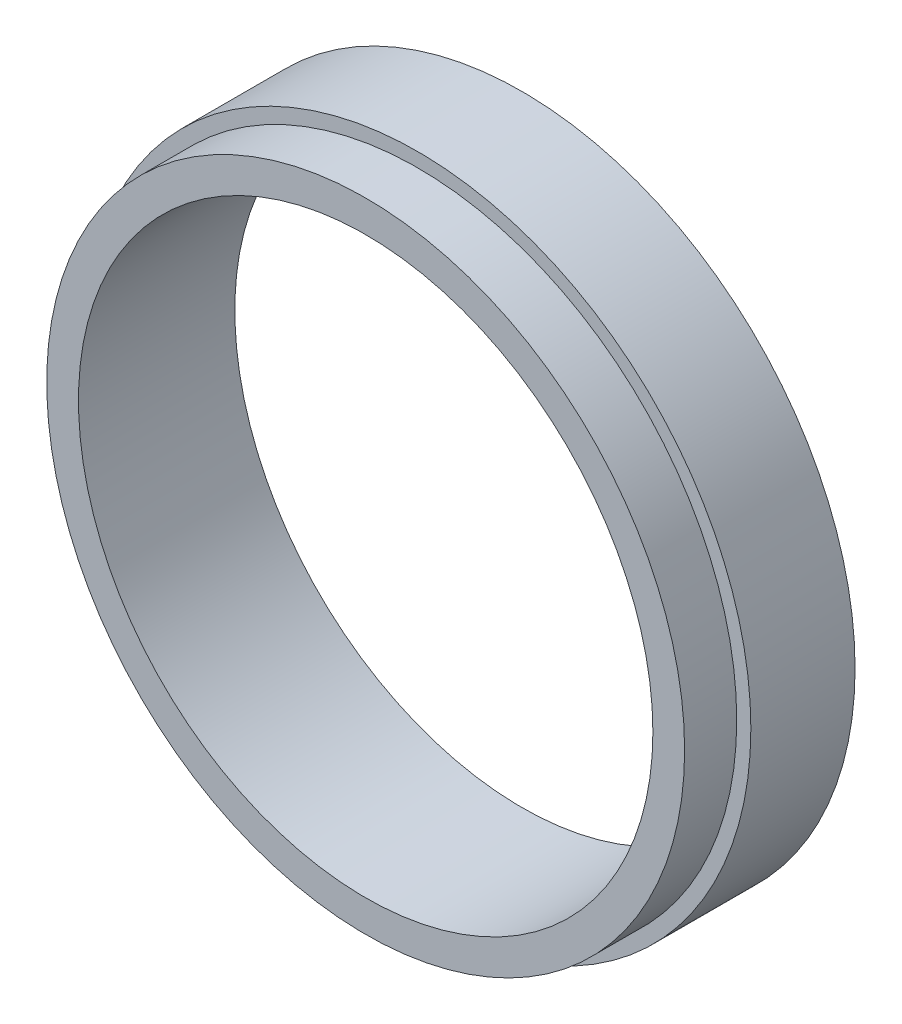
ISO-10303-21;
HEADER;
FILE_DESCRIPTION(('STEP AP214'),'2;1');
FILE_NAME('part.step','',(''),(''),'','','');
FILE_SCHEMA(('AUTOMOTIVE_DESIGN { 1 0 10303 214 1 1 1 1 }'));
ENDSEC;
DATA;
#1=APPLICATION_CONTEXT('core data for automotive mechanical design processes');
#2=APPLICATION_PROTOCOL_DEFINITION('international standard','automotive_design',2000,#1);
#3=PRODUCT_CONTEXT('',#1,'mechanical');
#4=PRODUCT('Part','Part','',(#3));
#5=PRODUCT_RELATED_PRODUCT_CATEGORY('part','',(#4));
#6=PRODUCT_DEFINITION_FORMATION('','',#4);
#7=PRODUCT_DEFINITION_CONTEXT('part definition',#1,'design');
#8=PRODUCT_DEFINITION('design','',#6,#7);
#9=PRODUCT_DEFINITION_SHAPE('','',#8);
#10=(LENGTH_UNIT() NAMED_UNIT(*) SI_UNIT(.MILLI.,.METRE.));
#11=(NAMED_UNIT(*) PLANE_ANGLE_UNIT() SI_UNIT($,.RADIAN.));
#12=(NAMED_UNIT(*) SI_UNIT($,.STERADIAN.) SOLID_ANGLE_UNIT());
#13=UNCERTAINTY_MEASURE_WITH_UNIT(LENGTH_MEASURE(1.E-05),#10,'distance_accuracy_value','');
#14=(GEOMETRIC_REPRESENTATION_CONTEXT(3) GLOBAL_UNCERTAINTY_ASSIGNED_CONTEXT((#13)) GLOBAL_UNIT_ASSIGNED_CONTEXT((#10,
#11,#12)) REPRESENTATION_CONTEXT('',''));
#15=CARTESIAN_POINT('',(0.,0.,0.));
#16=DIRECTION('',(0.,0.,1.));
#17=DIRECTION('',(1.,0.,0.));
#18=AXIS2_PLACEMENT_3D('',#15,#16,#17);
#19=CARTESIAN_POINT('',(0.,19.4336999999999,0.));
#20=DIRECTION('',(0.,0.,-1.));
#21=DIRECTION('',(-1.,0.,0.));
#22=AXIS2_PLACEMENT_3D('',#19,#20,#21);
#23=PLANE('',#22);
#24=CARTESIAN_POINT('',(0.,0.,0.));
#25=DIRECTION('',(0.,0.,1.));
#26=DIRECTION('',(1.,0.,0.));
#27=AXIS2_PLACEMENT_3D('',#24,#25,#26);
#28=CIRCLE('',#27,17.5);
#29=CARTESIAN_POINT('',(17.5,0.,0.));
#30=VERTEX_POINT('',#29);
#31=EDGE_CURVE('E10',#30,#30,#28,.T.);
#32=ORIENTED_EDGE('',*,*,#31,.F.);
#33=EDGE_LOOP('',(#32));
#34=FACE_BOUND('',#33,.T.);
#35=CARTESIAN_POINT('',(0.,0.,0.));
#36=DIRECTION('',(0.,0.,1.));
#37=DIRECTION('',(1.,0.,0.));
#38=AXIS2_PLACEMENT_3D('',#35,#36,#37);
#39=CIRCLE('',#38,19.4336999999999);
#40=CARTESIAN_POINT('',(19.4336999999999,0.,0.));
#41=VERTEX_POINT('',#40);
#42=EDGE_CURVE('E53',#41,#41,#39,.T.);
#43=ORIENTED_EDGE('',*,*,#42,.T.);
#44=EDGE_LOOP('',(#43));
#45=FACE_BOUND('',#44,.T.);
#46=ADVANCED_FACE('F31',(#34,#45),#23,.F.);
#47=CARTESIAN_POINT('',(0.,0.,1000.));
#48=DIRECTION('',(0.,0.,1.));
#49=DIRECTION('',(1.,0.,0.));
#50=AXIS2_PLACEMENT_3D('',#47,#48,#49);
#51=CYLINDRICAL_SURFACE('',#50,17.5);
#52=CARTESIAN_POINT('',(0.,0.,-9.52500000000001));
#53=DIRECTION('',(0.,0.,1.));
#54=DIRECTION('',(1.,0.,0.));
#55=AXIS2_PLACEMENT_3D('',#52,#53,#54);
#56=CIRCLE('',#55,17.5);
#57=CARTESIAN_POINT('',(17.5,0.,-9.52500000000001));
#58=VERTEX_POINT('',#57);
#59=EDGE_CURVE('E37',#58,#58,#56,.T.);
#60=ORIENTED_EDGE('',*,*,#59,.F.);
#61=EDGE_LOOP('',(#60));
#62=FACE_BOUND('',#61,.T.);
#63=ORIENTED_EDGE('',*,*,#31,.T.);
#64=EDGE_LOOP('',(#63));
#65=FACE_BOUND('',#64,.T.);
#66=ADVANCED_FACE('F78',(#62,#65),#51,.F.);
#67=CARTESIAN_POINT('',(0.,17.5,-9.525));
#68=DIRECTION('',(0.,0.,1.));
#69=DIRECTION('',(1.,0.,0.));
#70=AXIS2_PLACEMENT_3D('',#67,#68,#69);
#71=PLANE('',#70);
#72=CARTESIAN_POINT('',(0.,0.,-9.52500000000001));
#73=DIRECTION('',(0.,0.,1.));
#74=DIRECTION('',(1.,0.,0.));
#75=AXIS2_PLACEMENT_3D('',#72,#73,#74);
#76=CIRCLE('',#75,20.294);
#77=CARTESIAN_POINT('',(20.294,0.,-9.52500000000001));
#78=VERTEX_POINT('',#77);
#79=EDGE_CURVE('E41',#78,#78,#76,.T.);
#80=ORIENTED_EDGE('',*,*,#79,.F.);
#81=EDGE_LOOP('',(#80));
#82=FACE_BOUND('',#81,.T.);
#83=ORIENTED_EDGE('',*,*,#59,.T.);
#84=EDGE_LOOP('',(#83));
#85=FACE_BOUND('',#84,.T.);
#86=ADVANCED_FACE('F73',(#82,#85),#71,.F.);
#87=CARTESIAN_POINT('',(0.,0.,1000.));
#88=DIRECTION('',(0.,0.,1.));
#89=DIRECTION('',(1.,0.,0.));
#90=AXIS2_PLACEMENT_3D('',#87,#88,#89);
#91=CYLINDRICAL_SURFACE('',#90,20.294);
#92=CARTESIAN_POINT('',(0.,0.,-3.17499999999993));
#93=DIRECTION('',(0.,0.,1.));
#94=DIRECTION('',(1.,0.,0.));
#95=AXIS2_PLACEMENT_3D('',#92,#93,#94);
#96=CIRCLE('',#95,20.294);
#97=CARTESIAN_POINT('',(20.294,0.,-3.17499999999993));
#98=VERTEX_POINT('',#97);
#99=EDGE_CURVE('E45',#98,#98,#96,.T.);
#100=ORIENTED_EDGE('',*,*,#99,.F.);
#101=EDGE_LOOP('',(#100));
#102=FACE_BOUND('',#101,.T.);
#103=ORIENTED_EDGE('',*,*,#79,.T.);
#104=EDGE_LOOP('',(#103));
#105=FACE_BOUND('',#104,.T.);
#106=ADVANCED_FACE('F67',(#102,#105),#91,.T.);
#107=CARTESIAN_POINT('',(0.,20.294,-3.175));
#108=DIRECTION('',(0.,0.,-1.));
#109=DIRECTION('',(-1.,0.,0.));
#110=AXIS2_PLACEMENT_3D('',#107,#108,#109);
#111=PLANE('',#110);
#112=CARTESIAN_POINT('',(0.,0.,-3.17499999999993));
#113=DIRECTION('',(0.,0.,1.));
#114=DIRECTION('',(1.,0.,0.));
#115=AXIS2_PLACEMENT_3D('',#112,#113,#114);
#116=CIRCLE('',#115,19.4336999999999);
#117=CARTESIAN_POINT('',(19.4336999999999,0.,-3.17499999999993));
#118=VERTEX_POINT('',#117);
#119=EDGE_CURVE('E50',#118,#118,#116,.T.);
#120=ORIENTED_EDGE('',*,*,#119,.F.);
#121=EDGE_LOOP('',(#120));
#122=FACE_BOUND('',#121,.T.);
#123=ORIENTED_EDGE('',*,*,#99,.T.);
#124=EDGE_LOOP('',(#123));
#125=FACE_BOUND('',#124,.T.);
#126=ADVANCED_FACE('F61',(#122,#125),#111,.F.);
#127=CARTESIAN_POINT('',(0.,0.,1000.));
#128=DIRECTION('',(0.,0.,1.));
#129=DIRECTION('',(1.,0.,0.));
#130=AXIS2_PLACEMENT_3D('',#127,#128,#129);
#131=CYLINDRICAL_SURFACE('',#130,19.4336999999999);
#132=ORIENTED_EDGE('',*,*,#42,.F.);
#133=EDGE_LOOP('',(#132));
#134=FACE_BOUND('',#133,.T.);
#135=ORIENTED_EDGE('',*,*,#119,.T.);
#136=EDGE_LOOP('',(#135));
#137=FACE_BOUND('',#136,.T.);
#138=ADVANCED_FACE('F58',(#134,#137),#131,.T.);
#139=CLOSED_SHELL('',(#46,#66,#86,#106,#126,#138));
#140=MANIFOLD_SOLID_BREP('B2',#139);
#141=ADVANCED_BREP_SHAPE_REPRESENTATION('',(#18,#140),#14);
#142=SHAPE_DEFINITION_REPRESENTATION(#9,#141);
ENDSEC;
END-ISO-10303-21;
